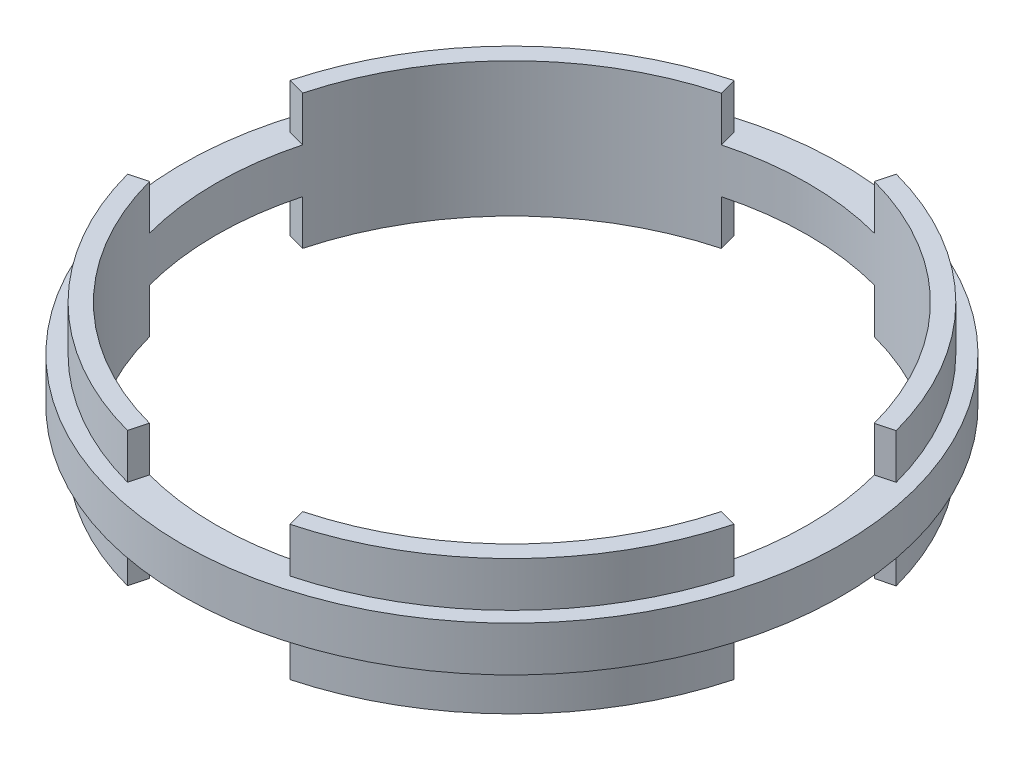
ISO-10303-21;
HEADER;
FILE_DESCRIPTION(('STEP AP214'),'2;1');
FILE_NAME('part.step','',(''),(''),'','','');
FILE_SCHEMA(('AUTOMOTIVE_DESIGN { 1 0 10303 214 1 1 1 1 }'));
ENDSEC;
DATA;
#1=APPLICATION_CONTEXT('core data for automotive mechanical design processes');
#2=APPLICATION_PROTOCOL_DEFINITION('international standard','automotive_design',2000,#1);
#3=PRODUCT_CONTEXT('',#1,'mechanical');
#4=PRODUCT('Part','Part','',(#3));
#5=PRODUCT_RELATED_PRODUCT_CATEGORY('part','',(#4));
#6=PRODUCT_DEFINITION_FORMATION('','',#4);
#7=PRODUCT_DEFINITION_CONTEXT('part definition',#1,'design');
#8=PRODUCT_DEFINITION('design','',#6,#7);
#9=PRODUCT_DEFINITION_SHAPE('','',#8);
#10=(LENGTH_UNIT() NAMED_UNIT(*) SI_UNIT(.MILLI.,.METRE.));
#11=(NAMED_UNIT(*) PLANE_ANGLE_UNIT() SI_UNIT($,.RADIAN.));
#12=(NAMED_UNIT(*) SI_UNIT($,.STERADIAN.) SOLID_ANGLE_UNIT());
#13=UNCERTAINTY_MEASURE_WITH_UNIT(LENGTH_MEASURE(1.E-05),#10,'distance_accuracy_value','');
#14=(GEOMETRIC_REPRESENTATION_CONTEXT(3) GLOBAL_UNCERTAINTY_ASSIGNED_CONTEXT((#13)) GLOBAL_UNIT_ASSIGNED_CONTEXT((#10,
#11,#12)) REPRESENTATION_CONTEXT('',''));
#15=CARTESIAN_POINT('',(0.,0.,0.));
#16=DIRECTION('',(0.,0.,1.));
#17=DIRECTION('',(1.,0.,0.));
#18=AXIS2_PLACEMENT_3D('',#15,#16,#17);
#19=CARTESIAN_POINT('',(0.,-38.1,0.));
#20=DIRECTION('',(0.965925826289068,0.,0.258819045102521));
#21=DIRECTION('',(0.258819045102521,0.,-0.965925826289068));
#22=AXIS2_PLACEMENT_3D('',#19,#20,#21);
#23=PLANE('',#22);
#24=DIRECTION('',(-0.258819045102521,0.,0.965925826289068));
#25=VECTOR('',#24,1.);
#26=CARTESIAN_POINT('',(0.,-6.35,0.));
#27=LINE('',#26,#25);
#28=CARTESIAN_POINT('',(23.0090131096141,-6.35000000000002,-85.8708059570982));
#29=VERTEX_POINT('',#28);
#30=CARTESIAN_POINT('',(21.6942123604933,-6.35,-80.9639027595497));
#31=VERTEX_POINT('',#30);
#32=EDGE_CURVE('E306',#29,#31,#27,.T.);
#33=ORIENTED_EDGE('',*,*,#32,.F.);
#34=DIRECTION('',(0.,1.,0.));
#35=VECTOR('',#34,1.);
#36=CARTESIAN_POINT('',(23.0090131096141,-38.1,-85.8708059570982));
#37=LINE('',#36,#35);
#38=CARTESIAN_POINT('',(23.0090131096141,-19.05,-85.8708059570982));
#39=VERTEX_POINT('',#38);
#40=EDGE_CURVE('E436',#39,#29,#37,.T.);
#41=ORIENTED_EDGE('',*,*,#40,.F.);
#42=DIRECTION('',(0.258819045102521,0.,-0.965925826289068));
#43=VECTOR('',#42,1.);
#44=CARTESIAN_POINT('',(0.,-19.05,0.));
#45=LINE('',#44,#43);
#46=CARTESIAN_POINT('',(21.6942123604933,-19.05,-80.9639027595497));
#47=VERTEX_POINT('',#46);
#48=EDGE_CURVE('E455',#47,#39,#45,.T.);
#49=ORIENTED_EDGE('',*,*,#48,.F.);
#50=DIRECTION('',(0.,-1.,0.));
#51=VECTOR('',#50,1.);
#52=CARTESIAN_POINT('',(21.6942123604933,6.35,-80.9639027595497));
#53=LINE('',#52,#51);
#54=EDGE_CURVE('E63',#47,#31,#53,.F.);
#55=ORIENTED_EDGE('',*,*,#54,.T.);
#56=EDGE_LOOP('',(#33,#41,#49,#55));
#57=FACE_BOUND('',#56,.T.);
#58=ADVANCED_FACE('F39',(#57),#23,.F.);
#59=CARTESIAN_POINT('',(0.,-38.1,0.));
#60=DIRECTION('',(-0.966058392081648,0.,0.2583237950492));
#61=DIRECTION('',(0.2583237950492,0.,0.966058392081648));
#62=AXIS2_PLACEMENT_3D('',#59,#60,#61);
#63=PLANE('',#62);
#64=DIRECTION('',(-0.2583237950492,0.,-0.966058392081648));
#65=VECTOR('',#64,1.);
#66=CARTESIAN_POINT('',(0.,-6.35,0.));
#67=LINE('',#66,#65);
#68=CARTESIAN_POINT('',(-21.6527005010239,-6.35,-80.9750144242837));
#69=VERTEX_POINT('',#68);
#70=CARTESIAN_POINT('',(-22.9649853798738,-6.35000000000002,-85.8825910560585));
#71=VERTEX_POINT('',#70);
#72=EDGE_CURVE('E305',#69,#71,#67,.T.);
#73=ORIENTED_EDGE('',*,*,#72,.F.);
#74=DIRECTION('',(0.,-1.,0.));
#75=VECTOR('',#74,1.);
#76=CARTESIAN_POINT('',(-21.6527005010239,6.35,-80.9750144242837));
#77=LINE('',#76,#75);
#78=CARTESIAN_POINT('',(-21.6527005010239,-19.05,-80.9750144242837));
#79=VERTEX_POINT('',#78);
#80=EDGE_CURVE('E309',#69,#79,#77,.T.);
#81=ORIENTED_EDGE('',*,*,#80,.T.);
#82=DIRECTION('',(0.2583237950492,0.,0.966058392081648));
#83=VECTOR('',#82,1.);
#84=CARTESIAN_POINT('',(0.,-19.05,0.));
#85=LINE('',#84,#83);
#86=CARTESIAN_POINT('',(-22.9649853798738,-19.05,-85.8825910560585));
#87=VERTEX_POINT('',#86);
#88=EDGE_CURVE('E445',#87,#79,#85,.T.);
#89=ORIENTED_EDGE('',*,*,#88,.F.);
#90=DIRECTION('',(0.,1.,0.));
#91=VECTOR('',#90,1.);
#92=CARTESIAN_POINT('',(-22.9649853798738,-38.1,-85.8825910560585));
#93=LINE('',#92,#91);
#94=EDGE_CURVE('E322',#87,#71,#93,.T.);
#95=ORIENTED_EDGE('',*,*,#94,.T.);
#96=EDGE_LOOP('',(#73,#81,#89,#95));
#97=FACE_BOUND('',#96,.T.);
#98=ADVANCED_FACE('F320',(#97),#63,.F.);
#99=CARTESIAN_POINT('',(0.,-38.1,0.));
#100=DIRECTION('',(0.258819045102518,0.,-0.965925826289069));
#101=DIRECTION('',(-0.965925826289069,0.,-0.258819045102518));
#102=AXIS2_PLACEMENT_3D('',#99,#100,#101);
#103=PLANE('',#102);
#104=DIRECTION('',(0.965925826289069,0.,0.258819045102518));
#105=VECTOR('',#104,1.);
#106=CARTESIAN_POINT('',(0.,-6.35,0.));
#107=LINE('',#106,#105);
#108=CARTESIAN_POINT('',(-85.8708059570982,-6.35000000000003,-23.0090131096138));
#109=VERTEX_POINT('',#108);
#110=CARTESIAN_POINT('',(-80.9639027595498,-6.35,-21.6942123604931));
#111=VERTEX_POINT('',#110);
#112=EDGE_CURVE('E324',#109,#111,#107,.T.);
#113=ORIENTED_EDGE('',*,*,#112,.F.);
#114=DIRECTION('',(0.,1.,0.));
#115=VECTOR('',#114,1.);
#116=CARTESIAN_POINT('',(-85.8708059570982,-38.1,-23.0090131096138));
#117=LINE('',#116,#115);
#118=CARTESIAN_POINT('',(-85.8708059570982,-19.05,-23.0090131096138));
#119=VERTEX_POINT('',#118);
#120=EDGE_CURVE('E406',#119,#109,#117,.T.);
#121=ORIENTED_EDGE('',*,*,#120,.F.);
#122=DIRECTION('',(-0.965925826289069,0.,-0.258819045102518));
#123=VECTOR('',#122,1.);
#124=CARTESIAN_POINT('',(0.,-19.05,0.));
#125=LINE('',#124,#123);
#126=CARTESIAN_POINT('',(-80.9639027595498,-19.05,-21.6942123604931));
#127=VERTEX_POINT('',#126);
#128=EDGE_CURVE('E432',#127,#119,#125,.T.);
#129=ORIENTED_EDGE('',*,*,#128,.F.);
#130=DIRECTION('',(0.,-1.,0.));
#131=VECTOR('',#130,1.);
#132=CARTESIAN_POINT('',(-80.9639027595498,6.35,-21.6942123604931));
#133=LINE('',#132,#131);
#134=EDGE_CURVE('E429',#127,#111,#133,.F.);
#135=ORIENTED_EDGE('',*,*,#134,.T.);
#136=EDGE_LOOP('',(#113,#121,#129,#135));
#137=FACE_BOUND('',#136,.T.);
#138=ADVANCED_FACE('F657',(#137),#103,.F.);
#139=CARTESIAN_POINT('',(0.,-38.1,0.));
#140=DIRECTION('',(0.258323795049203,0.,0.966058392081647));
#141=DIRECTION('',(0.966058392081647,0.,-0.258323795049203));
#142=AXIS2_PLACEMENT_3D('',#139,#140,#141);
#143=PLANE('',#142);
#144=DIRECTION('',(-0.966058392081647,0.,0.258323795049203));
#145=VECTOR('',#144,1.);
#146=CARTESIAN_POINT('',(0.,-6.35,0.));
#147=LINE('',#146,#145);
#148=CARTESIAN_POINT('',(-80.9750144242836,-6.35,21.6527005010242));
#149=VERTEX_POINT('',#148);
#150=CARTESIAN_POINT('',(-85.8825910560584,-6.35000000000003,22.9649853798741));
#151=VERTEX_POINT('',#150);
#152=EDGE_CURVE('E331',#149,#151,#147,.T.);
#153=ORIENTED_EDGE('',*,*,#152,.F.);
#154=DIRECTION('',(0.,-1.,0.));
#155=VECTOR('',#154,1.);
#156=CARTESIAN_POINT('',(-80.9750144242836,6.35,21.6527005010242));
#157=LINE('',#156,#155);
#158=CARTESIAN_POINT('',(-80.9750144242836,-19.05,21.6527005010242));
#159=VERTEX_POINT('',#158);
#160=EDGE_CURVE('E417',#149,#159,#157,.T.);
#161=ORIENTED_EDGE('',*,*,#160,.T.);
#162=DIRECTION('',(0.966058392081647,0.,-0.258323795049203));
#163=VECTOR('',#162,1.);
#164=CARTESIAN_POINT('',(0.,-19.05,0.));
#165=LINE('',#164,#163);
#166=CARTESIAN_POINT('',(-85.8825910560584,-19.05,22.9649853798741));
#167=VERTEX_POINT('',#166);
#168=EDGE_CURVE('E421',#167,#159,#165,.T.);
#169=ORIENTED_EDGE('',*,*,#168,.F.);
#170=DIRECTION('',(0.,1.,0.));
#171=VECTOR('',#170,1.);
#172=CARTESIAN_POINT('',(-85.8825910560584,-38.1,22.9649853798741));
#173=LINE('',#172,#171);
#174=EDGE_CURVE('E407',#167,#151,#173,.T.);
#175=ORIENTED_EDGE('',*,*,#174,.T.);
#176=EDGE_LOOP('',(#153,#161,#169,#175));
#177=FACE_BOUND('',#176,.T.);
#178=ADVANCED_FACE('F555',(#177),#143,.F.);
#179=CARTESIAN_POINT('',(0.,-38.1,0.));
#180=DIRECTION('',(-0.965925826289068,0.,-0.258819045102521));
#181=DIRECTION('',(-0.258819045102521,0.,0.965925826289068));
#182=AXIS2_PLACEMENT_3D('',#179,#180,#181);
#183=PLANE('',#182);
#184=DIRECTION('',(0.258819045102521,0.,-0.965925826289068));
#185=VECTOR('',#184,1.);
#186=CARTESIAN_POINT('',(0.,-6.35,0.));
#187=LINE('',#186,#185);
#188=CARTESIAN_POINT('',(-23.0090131096141,-6.35000000000003,85.8708059570982));
#189=VERTEX_POINT('',#188);
#190=CARTESIAN_POINT('',(-21.6942123604933,-6.35,80.9639027595497));
#191=VERTEX_POINT('',#190);
#192=EDGE_CURVE('E273',#189,#191,#187,.T.);
#193=ORIENTED_EDGE('',*,*,#192,.F.);
#194=DIRECTION('',(0.,1.,0.));
#195=VECTOR('',#194,1.);
#196=CARTESIAN_POINT('',(-23.0090131096141,-38.1,85.8708059570982));
#197=LINE('',#196,#195);
#198=CARTESIAN_POINT('',(-23.0090131096141,-19.05,85.8708059570982));
#199=VERTEX_POINT('',#198);
#200=EDGE_CURVE('E383',#199,#189,#197,.T.);
#201=ORIENTED_EDGE('',*,*,#200,.F.);
#202=DIRECTION('',(-0.258819045102521,0.,0.965925826289068));
#203=VECTOR('',#202,1.);
#204=CARTESIAN_POINT('',(0.,-19.05,0.));
#205=LINE('',#204,#203);
#206=CARTESIAN_POINT('',(-21.6942123604933,-19.05,80.9639027595497));
#207=VERTEX_POINT('',#206);
#208=EDGE_CURVE('E402',#207,#199,#205,.T.);
#209=ORIENTED_EDGE('',*,*,#208,.F.);
#210=DIRECTION('',(0.,-1.,0.));
#211=VECTOR('',#210,1.);
#212=CARTESIAN_POINT('',(-21.6942123604933,6.35,80.9639027595497));
#213=LINE('',#212,#211);
#214=EDGE_CURVE('E399',#207,#191,#213,.F.);
#215=ORIENTED_EDGE('',*,*,#214,.T.);
#216=EDGE_LOOP('',(#193,#201,#209,#215));
#217=FACE_BOUND('',#216,.T.);
#218=ADVANCED_FACE('F718',(#217),#183,.F.);
#219=CARTESIAN_POINT('',(0.,-38.1,0.));
#220=DIRECTION('',(0.966058392081648,0.,-0.2583237950492));
#221=DIRECTION('',(-0.2583237950492,0.,-0.966058392081648));
#222=AXIS2_PLACEMENT_3D('',#219,#220,#221);
#223=PLANE('',#222);
#224=DIRECTION('',(0.2583237950492,0.,0.966058392081648));
#225=VECTOR('',#224,1.);
#226=CARTESIAN_POINT('',(0.,-6.35,0.));
#227=LINE('',#226,#225);
#228=CARTESIAN_POINT('',(21.6527005010239,-6.35,80.9750144242837));
#229=VERTEX_POINT('',#228);
#230=CARTESIAN_POINT('',(22.9649853798738,-6.35000000000003,85.8825910560585));
#231=VERTEX_POINT('',#230);
#232=EDGE_CURVE('E266',#229,#231,#227,.T.);
#233=ORIENTED_EDGE('',*,*,#232,.F.);
#234=DIRECTION('',(0.,-1.,0.));
#235=VECTOR('',#234,1.);
#236=CARTESIAN_POINT('',(21.6527005010239,6.35,80.9750144242837));
#237=LINE('',#236,#235);
#238=CARTESIAN_POINT('',(21.6527005010239,-19.05,80.9750144242837));
#239=VERTEX_POINT('',#238);
#240=EDGE_CURVE('E249',#229,#239,#237,.T.);
#241=ORIENTED_EDGE('',*,*,#240,.T.);
#242=DIRECTION('',(-0.2583237950492,0.,-0.966058392081648));
#243=VECTOR('',#242,1.);
#244=CARTESIAN_POINT('',(0.,-19.05,0.));
#245=LINE('',#244,#243);
#246=CARTESIAN_POINT('',(22.9649853798738,-19.05,85.8825910560585));
#247=VERTEX_POINT('',#246);
#248=EDGE_CURVE('E392',#247,#239,#245,.T.);
#249=ORIENTED_EDGE('',*,*,#248,.F.);
#250=DIRECTION('',(0.,1.,0.));
#251=VECTOR('',#250,1.);
#252=CARTESIAN_POINT('',(22.9649853798738,-38.1,85.8825910560585));
#253=LINE('',#252,#251);
#254=EDGE_CURVE('E269',#247,#231,#253,.T.);
#255=ORIENTED_EDGE('',*,*,#254,.T.);
#256=EDGE_LOOP('',(#233,#241,#249,#255));
#257=FACE_BOUND('',#256,.T.);
#258=ADVANCED_FACE('F267',(#257),#223,.F.);
#259=CARTESIAN_POINT('',(0.,-38.1,0.));
#260=DIRECTION('',(-0.258819045102511,0.,0.965925826289071));
#261=DIRECTION('',(0.965925826289071,0.,0.258819045102511));
#262=AXIS2_PLACEMENT_3D('',#259,#260,#261);
#263=PLANE('',#262);
#264=DIRECTION('',(-0.965925826289071,0.,-0.258819045102511));
#265=VECTOR('',#264,1.);
#266=CARTESIAN_POINT('',(0.,-6.35,0.));
#267=LINE('',#266,#265);
#268=CARTESIAN_POINT('',(85.8708059570984,-6.35000000000003,23.0090131096132));
#269=VERTEX_POINT('',#268);
#270=CARTESIAN_POINT('',(80.9639027595499,-6.35,21.6942123604925));
#271=VERTEX_POINT('',#270);
#272=EDGE_CURVE('E274',#269,#271,#267,.T.);
#273=ORIENTED_EDGE('',*,*,#272,.F.);
#274=DIRECTION('',(0.,1.,0.));
#275=VECTOR('',#274,1.);
#276=CARTESIAN_POINT('',(85.8708059570984,-38.1,23.0090131096132));
#277=LINE('',#276,#275);
#278=CARTESIAN_POINT('',(85.8708059570984,-19.05,23.0090131096132));
#279=VERTEX_POINT('',#278);
#280=EDGE_CURVE('E354',#279,#269,#277,.T.);
#281=ORIENTED_EDGE('',*,*,#280,.F.);
#282=DIRECTION('',(0.965925826289071,0.,0.258819045102511));
#283=VECTOR('',#282,1.);
#284=CARTESIAN_POINT('',(0.,-19.05,0.));
#285=LINE('',#284,#283);
#286=CARTESIAN_POINT('',(80.9639027595499,-19.05,21.6942123604925));
#287=VERTEX_POINT('',#286);
#288=EDGE_CURVE('E379',#287,#279,#285,.T.);
#289=ORIENTED_EDGE('',*,*,#288,.F.);
#290=DIRECTION('',(0.,-1.,0.));
#291=VECTOR('',#290,1.);
#292=CARTESIAN_POINT('',(80.9639027595499,6.35,21.6942123604925));
#293=LINE('',#292,#291);
#294=EDGE_CURVE('E376',#287,#271,#293,.F.);
#295=ORIENTED_EDGE('',*,*,#294,.T.);
#296=EDGE_LOOP('',(#273,#281,#289,#295));
#297=FACE_BOUND('',#296,.T.);
#298=ADVANCED_FACE('F679',(#297),#263,.F.);
#299=CARTESIAN_POINT('',(0.,-38.1,0.));
#300=DIRECTION('',(-0.25832379504921,0.,-0.966058392081645));
#301=DIRECTION('',(-0.966058392081645,0.,0.25832379504921));
#302=AXIS2_PLACEMENT_3D('',#299,#300,#301);
#303=PLANE('',#302);
#304=DIRECTION('',(0.966058392081645,0.,-0.25832379504921));
#305=VECTOR('',#304,1.);
#306=CARTESIAN_POINT('',(0.,-6.35,0.));
#307=LINE('',#306,#305);
#308=CARTESIAN_POINT('',(80.9750144242835,-6.35,-21.6527005010247));
#309=VERTEX_POINT('',#308);
#310=CARTESIAN_POINT('',(85.8825910560583,-6.35000000000003,-22.9649853798747));
#311=VERTEX_POINT('',#310);
#312=EDGE_CURVE('E48',#309,#311,#307,.T.);
#313=ORIENTED_EDGE('',*,*,#312,.F.);
#314=DIRECTION('',(0.,-1.,0.));
#315=VECTOR('',#314,1.);
#316=CARTESIAN_POINT('',(80.9750144242835,6.35,-21.6527005010247));
#317=LINE('',#316,#315);
#318=CARTESIAN_POINT('',(80.9750144242835,-19.05,-21.6527005010247));
#319=VERTEX_POINT('',#318);
#320=EDGE_CURVE('E364',#309,#319,#317,.T.);
#321=ORIENTED_EDGE('',*,*,#320,.T.);
#322=DIRECTION('',(-0.966058392081645,0.,0.25832379504921));
#323=VECTOR('',#322,1.);
#324=CARTESIAN_POINT('',(0.,-19.05,0.));
#325=LINE('',#324,#323);
#326=CARTESIAN_POINT('',(85.8825910560583,-19.05,-22.9649853798747));
#327=VERTEX_POINT('',#326);
#328=EDGE_CURVE('E368',#327,#319,#325,.T.);
#329=ORIENTED_EDGE('',*,*,#328,.F.);
#330=DIRECTION('',(0.,1.,0.));
#331=VECTOR('',#330,1.);
#332=CARTESIAN_POINT('',(85.8825910560583,-38.1,-22.9649853798747));
#333=LINE('',#332,#331);
#334=EDGE_CURVE('E355',#327,#311,#333,.T.);
#335=ORIENTED_EDGE('',*,*,#334,.T.);
#336=EDGE_LOOP('',(#313,#321,#329,#335));
#337=FACE_BOUND('',#336,.T.);
#338=ADVANCED_FACE('F537',(#337),#303,.F.);
#339=CARTESIAN_POINT('',(0.,19.05,0.));
#340=DIRECTION('',(0.,-1.,0.));
#341=DIRECTION('',(0.,0.,-1.));
#342=AXIS2_PLACEMENT_3D('',#339,#340,#341);
#343=CYLINDRICAL_SURFACE('',#342,88.9);
#344=CARTESIAN_POINT('',(0.,-19.05,0.));
#345=DIRECTION('',(0.,1.,0.));
#346=DIRECTION('',(0.,0.,1.));
#347=AXIS2_PLACEMENT_3D('',#344,#345,#346);
#348=CIRCLE('',#347,88.9);
#349=EDGE_CURVE('E713',#247,#279,#348,.T.);
#350=ORIENTED_EDGE('',*,*,#349,.T.);
#351=ORIENTED_EDGE('',*,*,#280,.T.);
#352=CARTESIAN_POINT('',(0.,-6.35,0.));
#353=DIRECTION('',(0.,1.,0.));
#354=DIRECTION('',(0.,0.,1.));
#355=AXIS2_PLACEMENT_3D('',#352,#353,#354);
#356=CIRCLE('',#355,88.9);
#357=EDGE_CURVE('E497',#269,#231,#356,.F.);
#358=ORIENTED_EDGE('',*,*,#357,.T.);
#359=ORIENTED_EDGE('',*,*,#254,.F.);
#360=EDGE_LOOP('',(#350,#351,#358,#359));
#361=FACE_BOUND('',#360,.T.);
#362=ADVANCED_FACE('F664',(#361),#343,.T.);
#363=CARTESIAN_POINT('',(0.,-19.05,0.));
#364=DIRECTION('',(0.,1.,0.));
#365=DIRECTION('',(0.,0.,1.));
#366=AXIS2_PLACEMENT_3D('',#363,#364,#365);
#367=PLANE('',#366);
#368=CARTESIAN_POINT('',(0.,-19.05,0.));
#369=DIRECTION('',(0.,1.,0.));
#370=DIRECTION('',(0.,0.,1.));
#371=AXIS2_PLACEMENT_3D('',#368,#369,#370);
#372=CIRCLE('',#371,83.82);
#373=EDGE_CURVE('E257',#239,#287,#372,.T.);
#374=ORIENTED_EDGE('',*,*,#373,.T.);
#375=ORIENTED_EDGE('',*,*,#288,.T.);
#376=ORIENTED_EDGE('',*,*,#349,.F.);
#377=ORIENTED_EDGE('',*,*,#248,.T.);
#378=EDGE_LOOP('',(#374,#375,#376,#377));
#379=FACE_BOUND('',#378,.T.);
#380=ADVANCED_FACE('F670',(#379),#367,.F.);
#381=CARTESIAN_POINT('',(0.,19.05,0.));
#382=DIRECTION('',(0.,1.,0.));
#383=DIRECTION('',(0.,0.,1.));
#384=AXIS2_PLACEMENT_3D('',#381,#382,#383);
#385=PLANE('',#384);
#386=DIRECTION('',(0.965925826289071,0.,0.258819045102511));
#387=VECTOR('',#386,1.);
#388=CARTESIAN_POINT('',(0.,19.05,0.));
#389=LINE('',#388,#387);
#390=CARTESIAN_POINT('',(80.9639027595499,19.05,21.6942123604925));
#391=VERTEX_POINT('',#390);
#392=CARTESIAN_POINT('',(85.8708059570984,19.05,23.0090131096132));
#393=VERTEX_POINT('',#392);
#394=EDGE_CURVE('E372',#391,#393,#389,.T.);
#395=ORIENTED_EDGE('',*,*,#394,.F.);
#396=CARTESIAN_POINT('',(0.,19.05,0.));
#397=DIRECTION('',(0.,1.,0.));
#398=DIRECTION('',(0.,0.,1.));
#399=AXIS2_PLACEMENT_3D('',#396,#397,#398);
#400=CIRCLE('',#399,83.82);
#401=CARTESIAN_POINT('',(21.6527005010239,19.05,80.9750144242837));
#402=VERTEX_POINT('',#401);
#403=EDGE_CURVE('E697',#402,#391,#400,.T.);
#404=ORIENTED_EDGE('',*,*,#403,.F.);
#405=DIRECTION('',(-0.2583237950492,0.,-0.966058392081648));
#406=VECTOR('',#405,1.);
#407=CARTESIAN_POINT('',(0.,19.05,0.));
#408=LINE('',#407,#406);
#409=CARTESIAN_POINT('',(22.9649853798738,19.05,85.8825910560585));
#410=VERTEX_POINT('',#409);
#411=EDGE_CURVE('E262',#410,#402,#408,.T.);
#412=ORIENTED_EDGE('',*,*,#411,.F.);
#413=CARTESIAN_POINT('',(0.,19.05,0.));
#414=DIRECTION('',(0.,1.,0.));
#415=DIRECTION('',(0.,0.,1.));
#416=AXIS2_PLACEMENT_3D('',#413,#414,#415);
#417=CIRCLE('',#416,88.9);
#418=EDGE_CURVE('E598',#410,#393,#417,.T.);
#419=ORIENTED_EDGE('',*,*,#418,.T.);
#420=EDGE_LOOP('',(#395,#404,#412,#419));
#421=FACE_BOUND('',#420,.T.);
#422=ADVANCED_FACE('F668',(#421),#385,.T.);
#423=CARTESIAN_POINT('',(0.,6.35,0.));
#424=DIRECTION('',(0.,1.,0.));
#425=DIRECTION('',(0.,0.,1.));
#426=AXIS2_PLACEMENT_3D('',#423,#424,#425);
#427=CIRCLE('',#426,88.9);
#428=CARTESIAN_POINT('',(85.8708059570984,6.34999999999999,23.0090131096132));
#429=VERTEX_POINT('',#428);
#430=CARTESIAN_POINT('',(22.9649853798738,6.35,85.8825910560585));
#431=VERTEX_POINT('',#430);
#432=EDGE_CURVE('E482',#429,#431,#427,.F.);
#433=ORIENTED_EDGE('',*,*,#432,.F.);
#434=DIRECTION('',(0.,-1.,0.));
#435=VECTOR('',#434,1.);
#436=CARTESIAN_POINT('',(85.8708059570984,19.05,23.0090131096132));
#437=LINE('',#436,#435);
#438=EDGE_CURVE('E530',#429,#393,#437,.F.);
#439=ORIENTED_EDGE('',*,*,#438,.T.);
#440=ORIENTED_EDGE('',*,*,#418,.F.);
#441=DIRECTION('',(0.,-1.,0.));
#442=VECTOR('',#441,1.);
#443=CARTESIAN_POINT('',(22.9649853798738,19.05,85.8825910560585));
#444=LINE('',#443,#442);
#445=EDGE_CURVE('E518',#410,#431,#444,.T.);
#446=ORIENTED_EDGE('',*,*,#445,.T.);
#447=EDGE_LOOP('',(#433,#439,#440,#446));
#448=FACE_BOUND('',#447,.T.);
#449=ADVANCED_FACE('F672',(#448),#343,.T.);
#450=EDGE_CURVE('E481',#167,#199,#348,.T.);
#451=ORIENTED_EDGE('',*,*,#450,.T.);
#452=ORIENTED_EDGE('',*,*,#200,.T.);
#453=EDGE_CURVE('E501',#189,#151,#356,.F.);
#454=ORIENTED_EDGE('',*,*,#453,.T.);
#455=ORIENTED_EDGE('',*,*,#174,.F.);
#456=EDGE_LOOP('',(#451,#452,#454,#455));
#457=FACE_BOUND('',#456,.T.);
#458=ADVANCED_FACE('F550',(#457),#343,.T.);
#459=EDGE_CURVE('E469',#159,#207,#372,.T.);
#460=ORIENTED_EDGE('',*,*,#459,.T.);
#461=ORIENTED_EDGE('',*,*,#208,.T.);
#462=ORIENTED_EDGE('',*,*,#450,.F.);
#463=ORIENTED_EDGE('',*,*,#168,.T.);
#464=EDGE_LOOP('',(#460,#461,#462,#463));
#465=FACE_BOUND('',#464,.T.);
#466=ADVANCED_FACE('F678',(#465),#367,.F.);
#467=DIRECTION('',(-0.258819045102521,0.,0.965925826289068));
#468=VECTOR('',#467,1.);
#469=CARTESIAN_POINT('',(0.,19.05,0.));
#470=LINE('',#469,#468);
#471=CARTESIAN_POINT('',(-21.6942123604933,19.05,80.9639027595497));
#472=VERTEX_POINT('',#471);
#473=CARTESIAN_POINT('',(-23.0090131096141,19.05,85.8708059570982));
#474=VERTEX_POINT('',#473);
#475=EDGE_CURVE('E395',#472,#474,#470,.T.);
#476=ORIENTED_EDGE('',*,*,#475,.F.);
#477=CARTESIAN_POINT('',(-80.9750144242837,19.05,21.6527005010242));
#478=VERTEX_POINT('',#477);
#479=EDGE_CURVE('E465',#478,#472,#400,.T.);
#480=ORIENTED_EDGE('',*,*,#479,.F.);
#481=DIRECTION('',(0.966058392081647,0.,-0.258323795049203));
#482=VECTOR('',#481,1.);
#483=CARTESIAN_POINT('',(0.,19.05,0.));
#484=LINE('',#483,#482);
#485=CARTESIAN_POINT('',(-85.8825910560584,19.05,22.9649853798741));
#486=VERTEX_POINT('',#485);
#487=EDGE_CURVE('E411',#486,#478,#484,.T.);
#488=ORIENTED_EDGE('',*,*,#487,.F.);
#489=EDGE_CURVE('E475',#486,#474,#417,.T.);
#490=ORIENTED_EDGE('',*,*,#489,.T.);
#491=EDGE_LOOP('',(#476,#480,#488,#490));
#492=FACE_BOUND('',#491,.T.);
#493=ADVANCED_FACE('F594',(#492),#385,.T.);
#494=CARTESIAN_POINT('',(-23.0090131096141,6.34999999999999,85.8708059570982));
#495=VERTEX_POINT('',#494);
#496=CARTESIAN_POINT('',(-85.8825910560584,6.35,22.9649853798741));
#497=VERTEX_POINT('',#496);
#498=EDGE_CURVE('E487',#495,#497,#427,.F.);
#499=ORIENTED_EDGE('',*,*,#498,.F.);
#500=DIRECTION('',(0.,-1.,0.));
#501=VECTOR('',#500,1.);
#502=CARTESIAN_POINT('',(-23.0090131096141,19.05,85.8708059570982));
#503=LINE('',#502,#501);
#504=EDGE_CURVE('E522',#495,#474,#503,.F.);
#505=ORIENTED_EDGE('',*,*,#504,.T.);
#506=ORIENTED_EDGE('',*,*,#489,.F.);
#507=DIRECTION('',(0.,-1.,0.));
#508=VECTOR('',#507,1.);
#509=CARTESIAN_POINT('',(-85.8825910560584,19.05,22.9649853798741));
#510=LINE('',#509,#508);
#511=EDGE_CURVE('E510',#486,#497,#510,.T.);
#512=ORIENTED_EDGE('',*,*,#511,.T.);
#513=EDGE_LOOP('',(#499,#505,#506,#512));
#514=FACE_BOUND('',#513,.T.);
#515=ADVANCED_FACE('F596',(#514),#343,.T.);
#516=EDGE_CURVE('E477',#87,#119,#348,.T.);
#517=ORIENTED_EDGE('',*,*,#516,.T.);
#518=ORIENTED_EDGE('',*,*,#120,.T.);
#519=EDGE_CURVE('E492',#109,#71,#356,.F.);
#520=ORIENTED_EDGE('',*,*,#519,.T.);
#521=ORIENTED_EDGE('',*,*,#94,.F.);
#522=EDGE_LOOP('',(#517,#518,#520,#521));
#523=FACE_BOUND('',#522,.T.);
#524=ADVANCED_FACE('F638',(#523),#343,.T.);
#525=EDGE_CURVE('E312',#79,#127,#372,.T.);
#526=ORIENTED_EDGE('',*,*,#525,.T.);
#527=ORIENTED_EDGE('',*,*,#128,.T.);
#528=ORIENTED_EDGE('',*,*,#516,.F.);
#529=ORIENTED_EDGE('',*,*,#88,.T.);
#530=EDGE_LOOP('',(#526,#527,#528,#529));
#531=FACE_BOUND('',#530,.T.);
#532=ADVANCED_FACE('F645',(#531),#367,.F.);
#533=DIRECTION('',(-0.965925826289069,0.,-0.258819045102518));
#534=VECTOR('',#533,1.);
#535=CARTESIAN_POINT('',(0.,19.05,0.));
#536=LINE('',#535,#534);
#537=CARTESIAN_POINT('',(-80.9639027595498,19.05,-21.6942123604931));
#538=VERTEX_POINT('',#537);
#539=CARTESIAN_POINT('',(-85.8708059570982,19.05,-23.0090131096138));
#540=VERTEX_POINT('',#539);
#541=EDGE_CURVE('E425',#538,#540,#536,.T.);
#542=ORIENTED_EDGE('',*,*,#541,.F.);
#543=CARTESIAN_POINT('',(-21.6527005010239,19.05,-80.9750144242837));
#544=VERTEX_POINT('',#543);
#545=EDGE_CURVE('E460',#544,#538,#400,.T.);
#546=ORIENTED_EDGE('',*,*,#545,.F.);
#547=DIRECTION('',(0.2583237950492,0.,0.966058392081648));
#548=VECTOR('',#547,1.);
#549=CARTESIAN_POINT('',(0.,19.05,0.));
#550=LINE('',#549,#548);
#551=CARTESIAN_POINT('',(-22.9649853798738,19.05,-85.8825910560585));
#552=VERTEX_POINT('',#551);
#553=EDGE_CURVE('E317',#552,#544,#550,.T.);
#554=ORIENTED_EDGE('',*,*,#553,.F.);
#555=EDGE_CURVE('E470',#552,#540,#417,.T.);
#556=ORIENTED_EDGE('',*,*,#555,.T.);
#557=EDGE_LOOP('',(#542,#546,#554,#556));
#558=FACE_BOUND('',#557,.T.);
#559=ADVANCED_FACE('F628',(#558),#385,.T.);
#560=CARTESIAN_POINT('',(-85.8708059570982,6.34999999999999,-23.0090131096138));
#561=VERTEX_POINT('',#560);
#562=CARTESIAN_POINT('',(-22.9649853798738,6.35,-85.8825910560585));
#563=VERTEX_POINT('',#562);
#564=EDGE_CURVE('E474',#561,#563,#427,.F.);
#565=ORIENTED_EDGE('',*,*,#564,.F.);
#566=DIRECTION('',(0.,-1.,0.));
#567=VECTOR('',#566,1.);
#568=CARTESIAN_POINT('',(-85.8708059570982,19.05,-23.0090131096138));
#569=LINE('',#568,#567);
#570=EDGE_CURVE('E514',#561,#540,#569,.F.);
#571=ORIENTED_EDGE('',*,*,#570,.T.);
#572=ORIENTED_EDGE('',*,*,#555,.F.);
#573=DIRECTION('',(0.,-1.,0.));
#574=VECTOR('',#573,1.);
#575=CARTESIAN_POINT('',(-22.9649853798738,19.05,-85.8825910560585));
#576=LINE('',#575,#574);
#577=EDGE_CURVE('E502',#552,#563,#576,.T.);
#578=ORIENTED_EDGE('',*,*,#577,.T.);
#579=EDGE_LOOP('',(#565,#571,#572,#578));
#580=FACE_BOUND('',#579,.T.);
#581=ADVANCED_FACE('F633',(#580),#343,.T.);
#582=CARTESIAN_POINT('',(0.,6.35,0.));
#583=DIRECTION('',(0.,1.,0.));
#584=DIRECTION('',(0.,0.,1.));
#585=AXIS2_PLACEMENT_3D('',#582,#583,#584);
#586=PLANE('',#585);
#587=CARTESIAN_POINT('',(0.,6.35,0.));
#588=DIRECTION('',(0.,1.,0.));
#589=DIRECTION('',(0.,0.,1.));
#590=AXIS2_PLACEMENT_3D('',#587,#588,#589);
#591=CIRCLE('',#590,93.345);
#592=CARTESIAN_POINT('',(0.,6.35,93.345));
#593=VERTEX_POINT('',#592);
#594=EDGE_CURVE('E488',#593,#593,#591,.T.);
#595=ORIENTED_EDGE('',*,*,#594,.T.);
#596=EDGE_LOOP('',(#595));
#597=FACE_BOUND('',#596,.T.);
#598=ORIENTED_EDGE('',*,*,#564,.T.);
#599=DIRECTION('',(-0.2583237950492,0.,-0.966058392081648));
#600=VECTOR('',#599,1.);
#601=CARTESIAN_POINT('',(0.,6.35,0.));
#602=LINE('',#601,#600);
#603=CARTESIAN_POINT('',(-21.6527005010239,6.35,-80.9750144242837));
#604=VERTEX_POINT('',#603);
#605=EDGE_CURVE('E349',#604,#563,#602,.T.);
#606=ORIENTED_EDGE('',*,*,#605,.F.);
#607=CARTESIAN_POINT('',(0.,6.35,0.));
#608=DIRECTION('',(0.,1.,0.));
#609=DIRECTION('',(0.,0.,1.));
#610=AXIS2_PLACEMENT_3D('',#607,#608,#609);
#611=CIRCLE('',#610,83.82);
#612=CARTESIAN_POINT('',(21.6942123604933,6.35,-80.9639027595497));
#613=VERTEX_POINT('',#612);
#614=EDGE_CURVE('E563',#613,#604,#611,.T.);
#615=ORIENTED_EDGE('',*,*,#614,.F.);
#616=DIRECTION('',(-0.258819045102521,0.,0.965925826289068));
#617=VECTOR('',#616,1.);
#618=CARTESIAN_POINT('',(0.,6.35,0.));
#619=LINE('',#618,#617);
#620=CARTESIAN_POINT('',(23.0090131096141,6.34999999999999,-85.8708059570982));
#621=VERTEX_POINT('',#620);
#622=EDGE_CURVE('E55',#621,#613,#619,.T.);
#623=ORIENTED_EDGE('',*,*,#622,.F.);
#624=CARTESIAN_POINT('',(85.8825910560583,6.35,-22.9649853798747));
#625=VERTEX_POINT('',#624);
#626=EDGE_CURVE('E486',#621,#625,#427,.F.);
#627=ORIENTED_EDGE('',*,*,#626,.T.);
#628=DIRECTION('',(0.966058392081645,0.,-0.25832379504921));
#629=VECTOR('',#628,1.);
#630=CARTESIAN_POINT('',(0.,6.35,0.));
#631=LINE('',#630,#629);
#632=CARTESIAN_POINT('',(80.9750144242835,6.35,-21.6527005010247));
#633=VERTEX_POINT('',#632);
#634=EDGE_CURVE('E11',#633,#625,#631,.T.);
#635=ORIENTED_EDGE('',*,*,#634,.F.);
#636=CARTESIAN_POINT('',(80.9639027595499,6.35,21.6942123604925));
#637=VERTEX_POINT('',#636);
#638=EDGE_CURVE('E299',#637,#633,#611,.T.);
#639=ORIENTED_EDGE('',*,*,#638,.F.);
#640=DIRECTION('',(-0.965925826289071,0.,-0.258819045102511));
#641=VECTOR('',#640,1.);
#642=CARTESIAN_POINT('',(0.,6.35,0.));
#643=LINE('',#642,#641);
#644=EDGE_CURVE('E328',#429,#637,#643,.T.);
#645=ORIENTED_EDGE('',*,*,#644,.F.);
#646=ORIENTED_EDGE('',*,*,#432,.T.);
#647=DIRECTION('',(0.2583237950492,0.,0.966058392081648));
#648=VECTOR('',#647,1.);
#649=CARTESIAN_POINT('',(0.,6.35,0.));
#650=LINE('',#649,#648);
#651=CARTESIAN_POINT('',(21.6527005010239,6.35,80.9750144242837));
#652=VERTEX_POINT('',#651);
#653=EDGE_CURVE('E337',#652,#431,#650,.T.);
#654=ORIENTED_EDGE('',*,*,#653,.F.);
#655=CARTESIAN_POINT('',(-21.6942123604933,6.35,80.9639027595497));
#656=VERTEX_POINT('',#655);
#657=EDGE_CURVE('E291',#656,#652,#611,.T.);
#658=ORIENTED_EDGE('',*,*,#657,.F.);
#659=DIRECTION('',(0.258819045102521,0.,-0.965925826289068));
#660=VECTOR('',#659,1.);
#661=CARTESIAN_POINT('',(0.,6.35,0.));
#662=LINE('',#661,#660);
#663=EDGE_CURVE('E340',#495,#656,#662,.T.);
#664=ORIENTED_EDGE('',*,*,#663,.F.);
#665=ORIENTED_EDGE('',*,*,#498,.T.);
#666=DIRECTION('',(-0.966058392081647,0.,0.258323795049203));
#667=VECTOR('',#666,1.);
#668=CARTESIAN_POINT('',(0.,6.35,0.));
#669=LINE('',#668,#667);
#670=CARTESIAN_POINT('',(-80.9750144242836,6.35,21.6527005010242));
#671=VERTEX_POINT('',#670);
#672=EDGE_CURVE('E343',#671,#497,#669,.T.);
#673=ORIENTED_EDGE('',*,*,#672,.F.);
#674=CARTESIAN_POINT('',(-80.9639027595498,6.35,-21.6942123604931));
#675=VERTEX_POINT('',#674);
#676=EDGE_CURVE('E298',#675,#671,#611,.T.);
#677=ORIENTED_EDGE('',*,*,#676,.F.);
#678=DIRECTION('',(0.965925826289069,0.,0.258819045102518));
#679=VECTOR('',#678,1.);
#680=CARTESIAN_POINT('',(0.,6.35,0.));
#681=LINE('',#680,#679);
#682=EDGE_CURVE('E346',#561,#675,#681,.T.);
#683=ORIENTED_EDGE('',*,*,#682,.F.);
#684=EDGE_LOOP('',(#598,#606,#615,#623,#627,#635,#639,#645,#646,#654,#658,#664,#665,#673,#677,#683));
#685=FACE_BOUND('',#684,.T.);
#686=ADVANCED_FACE('F583',(#597,#685),#586,.T.);
#687=CARTESIAN_POINT('',(0.,-6.35,0.));
#688=DIRECTION('',(0.,1.,0.));
#689=DIRECTION('',(0.,0.,1.));
#690=AXIS2_PLACEMENT_3D('',#687,#688,#689);
#691=PLANE('',#690);
#692=CARTESIAN_POINT('',(0.,-6.35,0.));
#693=DIRECTION('',(0.,1.,0.));
#694=DIRECTION('',(0.,0.,1.));
#695=AXIS2_PLACEMENT_3D('',#692,#693,#694);
#696=CIRCLE('',#695,93.345);
#697=CARTESIAN_POINT('',(0.,-6.35,93.345));
#698=VERTEX_POINT('',#697);
#699=EDGE_CURVE('E493',#698,#698,#696,.T.);
#700=ORIENTED_EDGE('',*,*,#699,.F.);
#701=EDGE_LOOP('',(#700));
#702=FACE_BOUND('',#701,.T.);
#703=EDGE_CURVE('E500',#29,#311,#356,.F.);
#704=ORIENTED_EDGE('',*,*,#703,.F.);
#705=ORIENTED_EDGE('',*,*,#32,.T.);
#706=CARTESIAN_POINT('',(0.,-6.35,0.));
#707=DIRECTION('',(0.,1.,0.));
#708=DIRECTION('',(0.,0.,1.));
#709=AXIS2_PLACEMENT_3D('',#706,#707,#708);
#710=CIRCLE('',#709,83.82);
#711=EDGE_CURVE('E286',#31,#69,#710,.T.);
#712=ORIENTED_EDGE('',*,*,#711,.T.);
#713=ORIENTED_EDGE('',*,*,#72,.T.);
#714=ORIENTED_EDGE('',*,*,#519,.F.);
#715=ORIENTED_EDGE('',*,*,#112,.T.);
#716=EDGE_CURVE('E281',#111,#149,#710,.T.);
#717=ORIENTED_EDGE('',*,*,#716,.T.);
#718=ORIENTED_EDGE('',*,*,#152,.T.);
#719=ORIENTED_EDGE('',*,*,#453,.F.);
#720=ORIENTED_EDGE('',*,*,#192,.T.);
#721=EDGE_CURVE('E254',#191,#229,#710,.T.);
#722=ORIENTED_EDGE('',*,*,#721,.T.);
#723=ORIENTED_EDGE('',*,*,#232,.T.);
#724=ORIENTED_EDGE('',*,*,#357,.F.);
#725=ORIENTED_EDGE('',*,*,#272,.T.);
#726=EDGE_CURVE('E283',#271,#309,#710,.T.);
#727=ORIENTED_EDGE('',*,*,#726,.T.);
#728=ORIENTED_EDGE('',*,*,#312,.T.);
#729=EDGE_LOOP('',(#704,#705,#712,#713,#714,#715,#717,#718,#719,#720,#722,#723,#724,#725,#727,#728));
#730=FACE_BOUND('',#729,.T.);
#731=ADVANCED_FACE('F278',(#702,#730),#691,.F.);
#732=CARTESIAN_POINT('',(0.,6.35,0.));
#733=DIRECTION('',(0.,-1.,0.));
#734=DIRECTION('',(0.,0.,-1.));
#735=AXIS2_PLACEMENT_3D('',#732,#733,#734);
#736=CYLINDRICAL_SURFACE('',#735,93.345);
#737=ORIENTED_EDGE('',*,*,#594,.F.);
#738=EDGE_LOOP('',(#737));
#739=FACE_BOUND('',#738,.T.);
#740=ORIENTED_EDGE('',*,*,#699,.T.);
#741=EDGE_LOOP('',(#740));
#742=FACE_BOUND('',#741,.T.);
#743=ADVANCED_FACE('F41',(#739,#742),#736,.T.);
#744=ORIENTED_EDGE('',*,*,#703,.T.);
#745=ORIENTED_EDGE('',*,*,#334,.F.);
#746=EDGE_CURVE('E464',#327,#39,#348,.T.);
#747=ORIENTED_EDGE('',*,*,#746,.T.);
#748=ORIENTED_EDGE('',*,*,#40,.T.);
#749=EDGE_LOOP('',(#744,#745,#747,#748));
#750=FACE_BOUND('',#749,.T.);
#751=ADVANCED_FACE('F541',(#750),#343,.T.);
#752=ORIENTED_EDGE('',*,*,#746,.F.);
#753=ORIENTED_EDGE('',*,*,#328,.T.);
#754=EDGE_CURVE('E459',#319,#47,#372,.T.);
#755=ORIENTED_EDGE('',*,*,#754,.T.);
#756=ORIENTED_EDGE('',*,*,#48,.T.);
#757=EDGE_LOOP('',(#752,#753,#755,#756));
#758=FACE_BOUND('',#757,.T.);
#759=ADVANCED_FACE('F650',(#758),#367,.F.);
#760=CARTESIAN_POINT('',(0.,6.35,0.));
#761=DIRECTION('',(0.,-1.,0.));
#762=DIRECTION('',(0.,0.,-1.));
#763=AXIS2_PLACEMENT_3D('',#760,#761,#762);
#764=CYLINDRICAL_SURFACE('',#763,83.82);
#765=CARTESIAN_POINT('',(21.6942123604933,19.05,-80.9639027595497));
#766=VERTEX_POINT('',#765);
#767=EDGE_CURVE('E452',#613,#766,#53,.F.);
#768=ORIENTED_EDGE('',*,*,#767,.F.);
#769=ORIENTED_EDGE('',*,*,#614,.T.);
#770=EDGE_CURVE('E316',#544,#604,#77,.T.);
#771=ORIENTED_EDGE('',*,*,#770,.F.);
#772=ORIENTED_EDGE('',*,*,#545,.T.);
#773=EDGE_CURVE('E428',#675,#538,#133,.F.);
#774=ORIENTED_EDGE('',*,*,#773,.F.);
#775=ORIENTED_EDGE('',*,*,#676,.T.);
#776=EDGE_CURVE('E418',#478,#671,#157,.T.);
#777=ORIENTED_EDGE('',*,*,#776,.F.);
#778=ORIENTED_EDGE('',*,*,#479,.T.);
#779=EDGE_CURVE('E398',#656,#472,#213,.F.);
#780=ORIENTED_EDGE('',*,*,#779,.F.);
#781=ORIENTED_EDGE('',*,*,#657,.T.);
#782=EDGE_CURVE('E261',#402,#652,#237,.T.);
#783=ORIENTED_EDGE('',*,*,#782,.F.);
#784=ORIENTED_EDGE('',*,*,#403,.T.);
#785=EDGE_CURVE('E375',#637,#391,#293,.F.);
#786=ORIENTED_EDGE('',*,*,#785,.F.);
#787=ORIENTED_EDGE('',*,*,#638,.T.);
#788=CARTESIAN_POINT('',(80.9750144242835,19.05,-21.6527005010247));
#789=VERTEX_POINT('',#788);
#790=EDGE_CURVE('E365',#789,#633,#317,.T.);
#791=ORIENTED_EDGE('',*,*,#790,.F.);
#792=EDGE_CURVE('E466',#789,#766,#400,.T.);
#793=ORIENTED_EDGE('',*,*,#792,.T.);
#794=EDGE_LOOP('',(#768,#769,#771,#772,#774,#775,#777,#778,#780,#781,#783,#784,#786,#787,#791,#793));
#795=FACE_BOUND('',#794,.T.);
#796=ORIENTED_EDGE('',*,*,#320,.F.);
#797=ORIENTED_EDGE('',*,*,#726,.F.);
#798=ORIENTED_EDGE('',*,*,#294,.F.);
#799=ORIENTED_EDGE('',*,*,#373,.F.);
#800=ORIENTED_EDGE('',*,*,#240,.F.);
#801=ORIENTED_EDGE('',*,*,#721,.F.);
#802=ORIENTED_EDGE('',*,*,#214,.F.);
#803=ORIENTED_EDGE('',*,*,#459,.F.);
#804=ORIENTED_EDGE('',*,*,#160,.F.);
#805=ORIENTED_EDGE('',*,*,#716,.F.);
#806=ORIENTED_EDGE('',*,*,#134,.F.);
#807=ORIENTED_EDGE('',*,*,#525,.F.);
#808=ORIENTED_EDGE('',*,*,#80,.F.);
#809=ORIENTED_EDGE('',*,*,#711,.F.);
#810=ORIENTED_EDGE('',*,*,#54,.F.);
#811=ORIENTED_EDGE('',*,*,#754,.F.);
#812=EDGE_LOOP('',(#796,#797,#798,#799,#800,#801,#802,#803,#804,#805,#806,#807,#808,#809,#810,#811));
#813=FACE_BOUND('',#812,.T.);
#814=ADVANCED_FACE('F251',(#795,#813),#764,.F.);
#815=DIRECTION('',(-0.966058392081645,0.,0.25832379504921));
#816=VECTOR('',#815,1.);
#817=CARTESIAN_POINT('',(0.,19.05,0.));
#818=LINE('',#817,#816);
#819=CARTESIAN_POINT('',(85.8825910560583,19.05,-22.9649853798747));
#820=VERTEX_POINT('',#819);
#821=EDGE_CURVE('E358',#820,#789,#818,.T.);
#822=ORIENTED_EDGE('',*,*,#821,.F.);
#823=CARTESIAN_POINT('',(23.0090131096141,19.05,-85.8708059570982));
#824=VERTEX_POINT('',#823);
#825=EDGE_CURVE('E476',#820,#824,#417,.T.);
#826=ORIENTED_EDGE('',*,*,#825,.T.);
#827=DIRECTION('',(0.258819045102521,0.,-0.965925826289068));
#828=VECTOR('',#827,1.);
#829=CARTESIAN_POINT('',(0.,19.05,0.));
#830=LINE('',#829,#828);
#831=EDGE_CURVE('E448',#766,#824,#830,.T.);
#832=ORIENTED_EDGE('',*,*,#831,.F.);
#833=ORIENTED_EDGE('',*,*,#792,.F.);
#834=EDGE_LOOP('',(#822,#826,#832,#833));
#835=FACE_BOUND('',#834,.T.);
#836=ADVANCED_FACE('F610',(#835),#385,.T.);
#837=ORIENTED_EDGE('',*,*,#825,.F.);
#838=DIRECTION('',(0.,-1.,0.));
#839=VECTOR('',#838,1.);
#840=CARTESIAN_POINT('',(85.8825910560583,19.05,-22.9649853798747));
#841=LINE('',#840,#839);
#842=EDGE_CURVE('E526',#820,#625,#841,.T.);
#843=ORIENTED_EDGE('',*,*,#842,.T.);
#844=ORIENTED_EDGE('',*,*,#626,.F.);
#845=DIRECTION('',(0.,-1.,0.));
#846=VECTOR('',#845,1.);
#847=CARTESIAN_POINT('',(23.0090131096141,19.05,-85.8708059570982));
#848=LINE('',#847,#846);
#849=EDGE_CURVE('E506',#621,#824,#848,.F.);
#850=ORIENTED_EDGE('',*,*,#849,.T.);
#851=EDGE_LOOP('',(#837,#843,#844,#850));
#852=FACE_BOUND('',#851,.T.);
#853=ADVANCED_FACE('F616',(#852),#343,.T.);
#854=ORIENTED_EDGE('',*,*,#849,.F.);
#855=ORIENTED_EDGE('',*,*,#622,.T.);
#856=ORIENTED_EDGE('',*,*,#767,.T.);
#857=ORIENTED_EDGE('',*,*,#831,.T.);
#858=EDGE_LOOP('',(#854,#855,#856,#857));
#859=FACE_BOUND('',#858,.T.);
#860=ADVANCED_FACE('F613',(#859),#23,.F.);
#861=ORIENTED_EDGE('',*,*,#770,.T.);
#862=ORIENTED_EDGE('',*,*,#605,.T.);
#863=ORIENTED_EDGE('',*,*,#577,.F.);
#864=ORIENTED_EDGE('',*,*,#553,.T.);
#865=EDGE_LOOP('',(#861,#862,#863,#864));
#866=FACE_BOUND('',#865,.T.);
#867=ADVANCED_FACE('F623',(#866),#63,.F.);
#868=ORIENTED_EDGE('',*,*,#570,.F.);
#869=ORIENTED_EDGE('',*,*,#682,.T.);
#870=ORIENTED_EDGE('',*,*,#773,.T.);
#871=ORIENTED_EDGE('',*,*,#541,.T.);
#872=EDGE_LOOP('',(#868,#869,#870,#871));
#873=FACE_BOUND('',#872,.T.);
#874=ADVANCED_FACE('F631',(#873),#103,.F.);
#875=ORIENTED_EDGE('',*,*,#776,.T.);
#876=ORIENTED_EDGE('',*,*,#672,.T.);
#877=ORIENTED_EDGE('',*,*,#511,.F.);
#878=ORIENTED_EDGE('',*,*,#487,.T.);
#879=EDGE_LOOP('',(#875,#876,#877,#878));
#880=FACE_BOUND('',#879,.T.);
#881=ADVANCED_FACE('F588',(#880),#143,.F.);
#882=ORIENTED_EDGE('',*,*,#504,.F.);
#883=ORIENTED_EDGE('',*,*,#663,.T.);
#884=ORIENTED_EDGE('',*,*,#779,.T.);
#885=ORIENTED_EDGE('',*,*,#475,.T.);
#886=EDGE_LOOP('',(#882,#883,#884,#885));
#887=FACE_BOUND('',#886,.T.);
#888=ADVANCED_FACE('F732',(#887),#183,.F.);
#889=ORIENTED_EDGE('',*,*,#782,.T.);
#890=ORIENTED_EDGE('',*,*,#653,.T.);
#891=ORIENTED_EDGE('',*,*,#445,.F.);
#892=ORIENTED_EDGE('',*,*,#411,.T.);
#893=EDGE_LOOP('',(#889,#890,#891,#892));
#894=FACE_BOUND('',#893,.T.);
#895=ADVANCED_FACE('F736',(#894),#223,.F.);
#896=ORIENTED_EDGE('',*,*,#438,.F.);
#897=ORIENTED_EDGE('',*,*,#644,.T.);
#898=ORIENTED_EDGE('',*,*,#785,.T.);
#899=ORIENTED_EDGE('',*,*,#394,.T.);
#900=EDGE_LOOP('',(#896,#897,#898,#899));
#901=FACE_BOUND('',#900,.T.);
#902=ADVANCED_FACE('F693',(#901),#263,.F.);
#903=ORIENTED_EDGE('',*,*,#790,.T.);
#904=ORIENTED_EDGE('',*,*,#634,.T.);
#905=ORIENTED_EDGE('',*,*,#842,.F.);
#906=ORIENTED_EDGE('',*,*,#821,.T.);
#907=EDGE_LOOP('',(#903,#904,#905,#906));
#908=FACE_BOUND('',#907,.T.);
#909=ADVANCED_FACE('F681',(#908),#303,.F.);
#910=CLOSED_SHELL('',(#58,#98,#138,#178,#218,#258,#298,#338,#362,#380,#422,#449,#458,#466,#493,
#515,#524,#532,#559,#581,#686,#731,#743,#751,#759,#814,#836,#853,#860,#867,#874,#881,#888,#895,
#902,#909));
#911=MANIFOLD_SOLID_BREP('B2',#910);
#912=ADVANCED_BREP_SHAPE_REPRESENTATION('',(#18,#911),#14);
#913=SHAPE_DEFINITION_REPRESENTATION(#9,#912);
ENDSEC;
END-ISO-10303-21;
